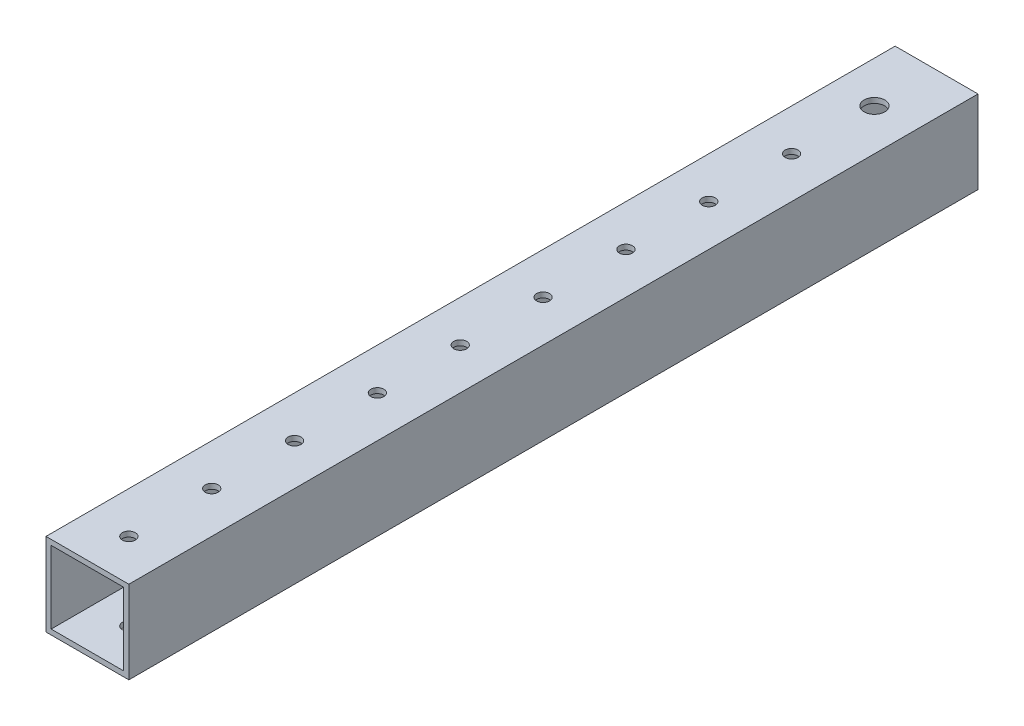
ISO-10303-21;
HEADER;
FILE_DESCRIPTION(('STEP AP214'),'2;1');
FILE_NAME('part.step','',(''),(''),'','','');
FILE_SCHEMA(('AUTOMOTIVE_DESIGN { 1 0 10303 214 1 1 1 1 }'));
ENDSEC;
DATA;
#1=APPLICATION_CONTEXT('core data for automotive mechanical design processes');
#2=APPLICATION_PROTOCOL_DEFINITION('international standard','automotive_design',2000,#1);
#3=PRODUCT_CONTEXT('',#1,'mechanical');
#4=PRODUCT('Part','Part','',(#3));
#5=PRODUCT_RELATED_PRODUCT_CATEGORY('part','',(#4));
#6=PRODUCT_DEFINITION_FORMATION('','',#4);
#7=PRODUCT_DEFINITION_CONTEXT('part definition',#1,'design');
#8=PRODUCT_DEFINITION('design','',#6,#7);
#9=PRODUCT_DEFINITION_SHAPE('','',#8);
#10=(LENGTH_UNIT() NAMED_UNIT(*) SI_UNIT(.MILLI.,.METRE.));
#11=(NAMED_UNIT(*) PLANE_ANGLE_UNIT() SI_UNIT($,.RADIAN.));
#12=(NAMED_UNIT(*) SI_UNIT($,.STERADIAN.) SOLID_ANGLE_UNIT());
#13=UNCERTAINTY_MEASURE_WITH_UNIT(LENGTH_MEASURE(1.E-05),#10,'distance_accuracy_value','');
#14=(GEOMETRIC_REPRESENTATION_CONTEXT(3) GLOBAL_UNCERTAINTY_ASSIGNED_CONTEXT((#13)) GLOBAL_UNIT_ASSIGNED_CONTEXT((#10,
#11,#12)) REPRESENTATION_CONTEXT('',''));
#15=CARTESIAN_POINT('',(0.,0.,0.));
#16=DIRECTION('',(0.,0.,1.));
#17=DIRECTION('',(1.,0.,0.));
#18=AXIS2_PLACEMENT_3D('',#15,#16,#17);
#19=CARTESIAN_POINT('',(0.,0.,260.35));
#20=DIRECTION('',(0.,0.,1.));
#21=DIRECTION('',(1.,0.,0.));
#22=AXIS2_PLACEMENT_3D('',#19,#20,#21);
#23=PLANE('',#22);
#24=DIRECTION('',(0.,1.,0.));
#25=VECTOR('',#24,1.);
#26=CARTESIAN_POINT('',(12.7,12.7,260.35));
#27=LINE('',#26,#25);
#28=CARTESIAN_POINT('',(12.7,-12.7,260.35));
#29=VERTEX_POINT('',#28);
#30=CARTESIAN_POINT('',(12.7,12.7,260.35));
#31=VERTEX_POINT('',#30);
#32=EDGE_CURVE('E140',#29,#31,#27,.T.);
#33=ORIENTED_EDGE('',*,*,#32,.T.);
#34=DIRECTION('',(-1.,0.,0.));
#35=VECTOR('',#34,1.);
#36=CARTESIAN_POINT('',(-12.7,12.7,260.35));
#37=LINE('',#36,#35);
#38=CARTESIAN_POINT('',(-12.7,12.7,260.35));
#39=VERTEX_POINT('',#38);
#40=EDGE_CURVE('E143',#31,#39,#37,.T.);
#41=ORIENTED_EDGE('',*,*,#40,.T.);
#42=DIRECTION('',(0.,-1.,0.));
#43=VECTOR('',#42,1.);
#44=CARTESIAN_POINT('',(-12.7,12.7,260.35));
#45=LINE('',#44,#43);
#46=CARTESIAN_POINT('',(-12.7,-12.7,260.35));
#47=VERTEX_POINT('',#46);
#48=EDGE_CURVE('E146',#39,#47,#45,.T.);
#49=ORIENTED_EDGE('',*,*,#48,.T.);
#50=DIRECTION('',(1.,0.,0.));
#51=VECTOR('',#50,1.);
#52=CARTESIAN_POINT('',(-12.7,-12.7,260.35));
#53=LINE('',#52,#51);
#54=EDGE_CURVE('E148',#47,#29,#53,.T.);
#55=ORIENTED_EDGE('',*,*,#54,.T.);
#56=EDGE_LOOP('',(#33,#41,#49,#55));
#57=FACE_BOUND('',#56,.T.);
#58=DIRECTION('',(-1.,0.,0.));
#59=VECTOR('',#58,1.);
#60=CARTESIAN_POINT('',(-11.1125,11.1125,260.35));
#61=LINE('',#60,#59);
#62=CARTESIAN_POINT('',(11.1125,11.1125,260.35));
#63=VERTEX_POINT('',#62);
#64=CARTESIAN_POINT('',(-11.1125,11.1125,260.35));
#65=VERTEX_POINT('',#64);
#66=EDGE_CURVE('E110',#63,#65,#61,.T.);
#67=ORIENTED_EDGE('',*,*,#66,.F.);
#68=DIRECTION('',(0.,1.,0.));
#69=VECTOR('',#68,1.);
#70=CARTESIAN_POINT('',(11.1125,11.1125,260.35));
#71=LINE('',#70,#69);
#72=CARTESIAN_POINT('',(11.1125,-11.1125,260.35));
#73=VERTEX_POINT('',#72);
#74=EDGE_CURVE('E102',#73,#63,#71,.T.);
#75=ORIENTED_EDGE('',*,*,#74,.F.);
#76=DIRECTION('',(1.,0.,0.));
#77=VECTOR('',#76,1.);
#78=CARTESIAN_POINT('',(-11.1125,-11.1125,260.35));
#79=LINE('',#78,#77);
#80=CARTESIAN_POINT('',(-11.1125,-11.1125,260.35));
#81=VERTEX_POINT('',#80);
#82=EDGE_CURVE('E124',#81,#73,#79,.T.);
#83=ORIENTED_EDGE('',*,*,#82,.F.);
#84=DIRECTION('',(0.,-1.,0.));
#85=VECTOR('',#84,1.);
#86=CARTESIAN_POINT('',(-11.1125,11.1125,260.35));
#87=LINE('',#86,#85);
#88=EDGE_CURVE('E122',#65,#81,#87,.T.);
#89=ORIENTED_EDGE('',*,*,#88,.F.);
#90=EDGE_LOOP('',(#67,#75,#83,#89));
#91=FACE_BOUND('',#90,.T.);
#92=ADVANCED_FACE('F35',(#57,#91),#23,.T.);
#93=CARTESIAN_POINT('',(0.,0.,0.));
#94=DIRECTION('',(0.,0.,1.));
#95=DIRECTION('',(1.,0.,0.));
#96=AXIS2_PLACEMENT_3D('',#93,#94,#95);
#97=PLANE('',#96);
#98=DIRECTION('',(0.,1.,0.));
#99=VECTOR('',#98,1.);
#100=CARTESIAN_POINT('',(12.7,12.7,0.));
#101=LINE('',#100,#99);
#102=CARTESIAN_POINT('',(12.7,-12.7,0.));
#103=VERTEX_POINT('',#102);
#104=CARTESIAN_POINT('',(12.7,12.7,0.));
#105=VERTEX_POINT('',#104);
#106=EDGE_CURVE('E118',#103,#105,#101,.T.);
#107=ORIENTED_EDGE('',*,*,#106,.F.);
#108=DIRECTION('',(1.,0.,0.));
#109=VECTOR('',#108,1.);
#110=CARTESIAN_POINT('',(-12.7,-12.7,0.));
#111=LINE('',#110,#109);
#112=CARTESIAN_POINT('',(-12.7,-12.7,0.));
#113=VERTEX_POINT('',#112);
#114=EDGE_CURVE('E144',#113,#103,#111,.T.);
#115=ORIENTED_EDGE('',*,*,#114,.F.);
#116=DIRECTION('',(0.,-1.,0.));
#117=VECTOR('',#116,1.);
#118=CARTESIAN_POINT('',(-12.7,12.7,0.));
#119=LINE('',#118,#117);
#120=CARTESIAN_POINT('',(-12.7,12.7,0.));
#121=VERTEX_POINT('',#120);
#122=EDGE_CURVE('E155',#121,#113,#119,.T.);
#123=ORIENTED_EDGE('',*,*,#122,.F.);
#124=DIRECTION('',(-1.,0.,0.));
#125=VECTOR('',#124,1.);
#126=CARTESIAN_POINT('',(-12.7,12.7,0.));
#127=LINE('',#126,#125);
#128=EDGE_CURVE('E153',#105,#121,#127,.T.);
#129=ORIENTED_EDGE('',*,*,#128,.F.);
#130=EDGE_LOOP('',(#107,#115,#123,#129));
#131=FACE_BOUND('',#130,.T.);
#132=DIRECTION('',(0.,1.,0.));
#133=VECTOR('',#132,1.);
#134=CARTESIAN_POINT('',(11.1125,11.1125,0.));
#135=LINE('',#134,#133);
#136=CARTESIAN_POINT('',(11.1125,-11.1125,0.));
#137=VERTEX_POINT('',#136);
#138=CARTESIAN_POINT('',(11.1125,11.1125,0.));
#139=VERTEX_POINT('',#138);
#140=EDGE_CURVE('E60',#137,#139,#135,.T.);
#141=ORIENTED_EDGE('',*,*,#140,.T.);
#142=DIRECTION('',(-1.,0.,0.));
#143=VECTOR('',#142,1.);
#144=CARTESIAN_POINT('',(-11.1125,11.1125,0.));
#145=LINE('',#144,#143);
#146=CARTESIAN_POINT('',(-11.1125,11.1125,0.));
#147=VERTEX_POINT('',#146);
#148=EDGE_CURVE('E117',#139,#147,#145,.T.);
#149=ORIENTED_EDGE('',*,*,#148,.T.);
#150=DIRECTION('',(0.,-1.,0.));
#151=VECTOR('',#150,1.);
#152=CARTESIAN_POINT('',(-11.1125,11.1125,0.));
#153=LINE('',#152,#151);
#154=CARTESIAN_POINT('',(-11.1125,-11.1125,0.));
#155=VERTEX_POINT('',#154);
#156=EDGE_CURVE('E132',#147,#155,#153,.T.);
#157=ORIENTED_EDGE('',*,*,#156,.T.);
#158=DIRECTION('',(1.,0.,0.));
#159=VECTOR('',#158,1.);
#160=CARTESIAN_POINT('',(-11.1125,-11.1125,0.));
#161=LINE('',#160,#159);
#162=EDGE_CURVE('E111',#155,#137,#161,.T.);
#163=ORIENTED_EDGE('',*,*,#162,.T.);
#164=EDGE_LOOP('',(#141,#149,#157,#163));
#165=FACE_BOUND('',#164,.T.);
#166=ADVANCED_FACE('F297',(#131,#165),#97,.F.);
#167=CARTESIAN_POINT('',(12.7,12.7,260.35));
#168=DIRECTION('',(-1.,0.,0.));
#169=DIRECTION('',(0.,-1.,0.));
#170=AXIS2_PLACEMENT_3D('',#167,#168,#169);
#171=PLANE('',#170);
#172=ORIENTED_EDGE('',*,*,#106,.T.);
#173=DIRECTION('',(0.,0.,-1.));
#174=VECTOR('',#173,1.);
#175=CARTESIAN_POINT('',(12.7,12.7,260.35));
#176=LINE('',#175,#174);
#177=EDGE_CURVE('E11',#31,#105,#176,.T.);
#178=ORIENTED_EDGE('',*,*,#177,.F.);
#179=ORIENTED_EDGE('',*,*,#32,.F.);
#180=DIRECTION('',(0.,0.,-1.));
#181=VECTOR('',#180,1.);
#182=CARTESIAN_POINT('',(12.7,-12.7,260.35));
#183=LINE('',#182,#181);
#184=EDGE_CURVE('E150',#29,#103,#183,.T.);
#185=ORIENTED_EDGE('',*,*,#184,.T.);
#186=EDGE_LOOP('',(#172,#178,#179,#185));
#187=FACE_BOUND('',#186,.T.);
#188=ADVANCED_FACE('F37',(#187),#171,.F.);
#189=CARTESIAN_POINT('',(-12.7,12.7,260.35));
#190=DIRECTION('',(0.,-1.,0.));
#191=DIRECTION('',(0.,0.,-1.));
#192=AXIS2_PLACEMENT_3D('',#189,#190,#191);
#193=PLANE('',#192);
#194=CARTESIAN_POINT('',(-7.09469008052924E-13,12.7,44.4500000000002));
#195=DIRECTION('',(0.,1.,0.));
#196=DIRECTION('',(0.,0.,1.));
#197=AXIS2_PLACEMENT_3D('',#194,#195,#196);
#198=CIRCLE('',#197,1.98437499999999);
#199=CARTESIAN_POINT('',(-7.09469008052924E-13,12.7,46.4343750000002));
#200=VERTEX_POINT('',#199);
#201=EDGE_CURVE('E322',#200,#200,#198,.T.);
#202=ORIENTED_EDGE('',*,*,#201,.F.);
#203=EDGE_LOOP('',(#202));
#204=FACE_BOUND('',#203,.T.);
#205=CARTESIAN_POINT('',(-6.20785382046309E-13,12.7,69.8500000000001));
#206=DIRECTION('',(0.,1.,0.));
#207=DIRECTION('',(0.,0.,1.));
#208=AXIS2_PLACEMENT_3D('',#205,#206,#207);
#209=CIRCLE('',#208,1.98437499999999);
#210=CARTESIAN_POINT('',(-6.20785382046309E-13,12.7,71.8343750000001));
#211=VERTEX_POINT('',#210);
#212=EDGE_CURVE('E213',#211,#211,#209,.T.);
#213=ORIENTED_EDGE('',*,*,#212,.F.);
#214=EDGE_LOOP('',(#213));
#215=FACE_BOUND('',#214,.T.);
#216=CARTESIAN_POINT('',(-5.32101756039693E-13,12.7,95.2500000000001));
#217=DIRECTION('',(0.,1.,0.));
#218=DIRECTION('',(0.,0.,1.));
#219=AXIS2_PLACEMENT_3D('',#216,#217,#218);
#220=CIRCLE('',#219,1.98437499999999);
#221=CARTESIAN_POINT('',(-5.32101756039693E-13,12.7,97.2343750000001));
#222=VERTEX_POINT('',#221);
#223=EDGE_CURVE('E210',#222,#222,#220,.T.);
#224=ORIENTED_EDGE('',*,*,#223,.F.);
#225=EDGE_LOOP('',(#224));
#226=FACE_BOUND('',#225,.T.);
#227=CARTESIAN_POINT('',(-4.43418130033078E-13,12.7,120.65));
#228=DIRECTION('',(0.,1.,0.));
#229=DIRECTION('',(0.,0.,1.));
#230=AXIS2_PLACEMENT_3D('',#227,#228,#229);
#231=CIRCLE('',#230,1.98437499999999);
#232=CARTESIAN_POINT('',(-4.43418130033078E-13,12.7,122.634375));
#233=VERTEX_POINT('',#232);
#234=EDGE_CURVE('E229',#233,#233,#231,.T.);
#235=ORIENTED_EDGE('',*,*,#234,.F.);
#236=EDGE_LOOP('',(#235));
#237=FACE_BOUND('',#236,.T.);
#238=CARTESIAN_POINT('',(-3.54734504026462E-13,12.7,146.05));
#239=DIRECTION('',(0.,1.,0.));
#240=DIRECTION('',(0.,0.,1.));
#241=AXIS2_PLACEMENT_3D('',#238,#239,#240);
#242=CIRCLE('',#241,1.984375);
#243=CARTESIAN_POINT('',(-3.54734504026462E-13,12.7,148.034375));
#244=VERTEX_POINT('',#243);
#245=EDGE_CURVE('E236',#244,#244,#242,.T.);
#246=ORIENTED_EDGE('',*,*,#245,.F.);
#247=EDGE_LOOP('',(#246));
#248=FACE_BOUND('',#247,.T.);
#249=CARTESIAN_POINT('',(-2.66050878019846E-13,12.7,171.45));
#250=DIRECTION('',(0.,1.,0.));
#251=DIRECTION('',(0.,0.,1.));
#252=AXIS2_PLACEMENT_3D('',#249,#250,#251);
#253=CIRCLE('',#252,1.984375);
#254=CARTESIAN_POINT('',(-2.66050878019846E-13,12.7,173.434375));
#255=VERTEX_POINT('',#254);
#256=EDGE_CURVE('E243',#255,#255,#253,.T.);
#257=ORIENTED_EDGE('',*,*,#256,.F.);
#258=EDGE_LOOP('',(#257));
#259=FACE_BOUND('',#258,.T.);
#260=CARTESIAN_POINT('',(-1.77367252013231E-13,12.7,196.85));
#261=DIRECTION('',(0.,1.,0.));
#262=DIRECTION('',(0.,0.,1.));
#263=AXIS2_PLACEMENT_3D('',#260,#261,#262);
#264=CIRCLE('',#263,1.984375);
#265=CARTESIAN_POINT('',(-1.77367252013231E-13,12.7,198.834375));
#266=VERTEX_POINT('',#265);
#267=EDGE_CURVE('E250',#266,#266,#264,.T.);
#268=ORIENTED_EDGE('',*,*,#267,.F.);
#269=EDGE_LOOP('',(#268));
#270=FACE_BOUND('',#269,.T.);
#271=CARTESIAN_POINT('',(0.,12.7,222.25));
#272=DIRECTION('',(0.,1.,0.));
#273=DIRECTION('',(0.,0.,1.));
#274=AXIS2_PLACEMENT_3D('',#271,#272,#273);
#275=CIRCLE('',#274,1.984375);
#276=CARTESIAN_POINT('',(0.,12.7,224.234375));
#277=VERTEX_POINT('',#276);
#278=EDGE_CURVE('E257',#277,#277,#275,.T.);
#279=ORIENTED_EDGE('',*,*,#278,.F.);
#280=EDGE_LOOP('',(#279));
#281=FACE_BOUND('',#280,.T.);
#282=CARTESIAN_POINT('',(-7.9815263405954E-13,12.7,19.0500000000002));
#283=DIRECTION('',(0.,1.,0.));
#284=DIRECTION('',(0.,0.,1.));
#285=AXIS2_PLACEMENT_3D('',#282,#283,#284);
#286=CIRCLE('',#285,3.175);
#287=CARTESIAN_POINT('',(-7.9815263405954E-13,12.7,22.2250000000002));
#288=VERTEX_POINT('',#287);
#289=EDGE_CURVE('E264',#288,#288,#286,.T.);
#290=ORIENTED_EDGE('',*,*,#289,.F.);
#291=EDGE_LOOP('',(#290));
#292=FACE_BOUND('',#291,.T.);
#293=CARTESIAN_POINT('',(0.,12.7,247.65));
#294=DIRECTION('',(0.,1.,0.));
#295=DIRECTION('',(0.,0.,1.));
#296=AXIS2_PLACEMENT_3D('',#293,#294,#295);
#297=CIRCLE('',#296,1.984375);
#298=CARTESIAN_POINT('',(0.,12.7,249.634375));
#299=VERTEX_POINT('',#298);
#300=EDGE_CURVE('E271',#299,#299,#297,.T.);
#301=ORIENTED_EDGE('',*,*,#300,.F.);
#302=EDGE_LOOP('',(#301));
#303=FACE_BOUND('',#302,.T.);
#304=ORIENTED_EDGE('',*,*,#128,.T.);
#305=DIRECTION('',(0.,0.,-1.));
#306=VECTOR('',#305,1.);
#307=CARTESIAN_POINT('',(-12.7,12.7,260.35));
#308=LINE('',#307,#306);
#309=EDGE_CURVE('E44',#39,#121,#308,.T.);
#310=ORIENTED_EDGE('',*,*,#309,.F.);
#311=ORIENTED_EDGE('',*,*,#40,.F.);
#312=ORIENTED_EDGE('',*,*,#177,.T.);
#313=EDGE_LOOP('',(#304,#310,#311,#312));
#314=FACE_BOUND('',#313,.T.);
#315=ADVANCED_FACE('F311',(#204,#215,#226,#237,#248,#259,#270,#281,#292,#303,#314),#193,.F.);
#316=CARTESIAN_POINT('',(-12.7,12.7,260.35));
#317=DIRECTION('',(1.,0.,0.));
#318=DIRECTION('',(0.,1.,0.));
#319=AXIS2_PLACEMENT_3D('',#316,#317,#318);
#320=PLANE('',#319);
#321=ORIENTED_EDGE('',*,*,#122,.T.);
#322=DIRECTION('',(0.,0.,-1.));
#323=VECTOR('',#322,1.);
#324=CARTESIAN_POINT('',(-12.7,-12.7,260.35));
#325=LINE('',#324,#323);
#326=EDGE_CURVE('E160',#47,#113,#325,.T.);
#327=ORIENTED_EDGE('',*,*,#326,.F.);
#328=ORIENTED_EDGE('',*,*,#48,.F.);
#329=ORIENTED_EDGE('',*,*,#309,.T.);
#330=EDGE_LOOP('',(#321,#327,#328,#329));
#331=FACE_BOUND('',#330,.T.);
#332=ADVANCED_FACE('F308',(#331),#320,.F.);
#333=CARTESIAN_POINT('',(-12.7,-12.7,260.35));
#334=DIRECTION('',(0.,1.,0.));
#335=DIRECTION('',(0.,0.,1.));
#336=AXIS2_PLACEMENT_3D('',#333,#334,#335);
#337=PLANE('',#336);
#338=CARTESIAN_POINT('',(-7.09469008052924E-13,-12.7,44.4500000000002));
#339=DIRECTION('',(0.,1.,0.));
#340=DIRECTION('',(0.,0.,1.));
#341=AXIS2_PLACEMENT_3D('',#338,#339,#340);
#342=CIRCLE('',#341,1.98437499999999);
#343=CARTESIAN_POINT('',(-7.09469008052924E-13,-12.7,46.4343750000002));
#344=VERTEX_POINT('',#343);
#345=EDGE_CURVE('E419',#344,#344,#342,.T.);
#346=ORIENTED_EDGE('',*,*,#345,.T.);
#347=EDGE_LOOP('',(#346));
#348=FACE_BOUND('',#347,.T.);
#349=CARTESIAN_POINT('',(-6.20785382046309E-13,-12.7,69.8500000000001));
#350=DIRECTION('',(0.,1.,0.));
#351=DIRECTION('',(0.,0.,1.));
#352=AXIS2_PLACEMENT_3D('',#349,#350,#351);
#353=CIRCLE('',#352,1.98437499999999);
#354=CARTESIAN_POINT('',(-6.20785382046309E-13,-12.7,71.8343750000001));
#355=VERTEX_POINT('',#354);
#356=EDGE_CURVE('E206',#355,#355,#353,.T.);
#357=ORIENTED_EDGE('',*,*,#356,.T.);
#358=EDGE_LOOP('',(#357));
#359=FACE_BOUND('',#358,.T.);
#360=CARTESIAN_POINT('',(-5.32101756039693E-13,-12.7,95.2500000000001));
#361=DIRECTION('',(0.,1.,0.));
#362=DIRECTION('',(0.,0.,1.));
#363=AXIS2_PLACEMENT_3D('',#360,#361,#362);
#364=CIRCLE('',#363,1.98437499999999);
#365=CARTESIAN_POINT('',(-5.32101756039693E-13,-12.7,97.2343750000001));
#366=VERTEX_POINT('',#365);
#367=EDGE_CURVE('E202',#366,#366,#364,.T.);
#368=ORIENTED_EDGE('',*,*,#367,.T.);
#369=EDGE_LOOP('',(#368));
#370=FACE_BOUND('',#369,.T.);
#371=CARTESIAN_POINT('',(-4.43418130033078E-13,-12.7,120.65));
#372=DIRECTION('',(0.,1.,0.));
#373=DIRECTION('',(0.,0.,1.));
#374=AXIS2_PLACEMENT_3D('',#371,#372,#373);
#375=CIRCLE('',#374,1.98437499999999);
#376=CARTESIAN_POINT('',(-4.43418130033078E-13,-12.7,122.634375));
#377=VERTEX_POINT('',#376);
#378=EDGE_CURVE('E198',#377,#377,#375,.T.);
#379=ORIENTED_EDGE('',*,*,#378,.T.);
#380=EDGE_LOOP('',(#379));
#381=FACE_BOUND('',#380,.T.);
#382=CARTESIAN_POINT('',(-3.54734504026462E-13,-12.7,146.05));
#383=DIRECTION('',(0.,1.,0.));
#384=DIRECTION('',(0.,0.,1.));
#385=AXIS2_PLACEMENT_3D('',#382,#383,#384);
#386=CIRCLE('',#385,1.984375);
#387=CARTESIAN_POINT('',(-3.54734504026462E-13,-12.7,148.034375));
#388=VERTEX_POINT('',#387);
#389=EDGE_CURVE('E193',#388,#388,#386,.T.);
#390=ORIENTED_EDGE('',*,*,#389,.T.);
#391=EDGE_LOOP('',(#390));
#392=FACE_BOUND('',#391,.T.);
#393=CARTESIAN_POINT('',(-2.66050878019846E-13,-12.7,171.45));
#394=DIRECTION('',(0.,1.,0.));
#395=DIRECTION('',(0.,0.,1.));
#396=AXIS2_PLACEMENT_3D('',#393,#394,#395);
#397=CIRCLE('',#396,1.984375);
#398=CARTESIAN_POINT('',(-2.66050878019846E-13,-12.7,173.434375));
#399=VERTEX_POINT('',#398);
#400=EDGE_CURVE('E188',#399,#399,#397,.T.);
#401=ORIENTED_EDGE('',*,*,#400,.T.);
#402=EDGE_LOOP('',(#401));
#403=FACE_BOUND('',#402,.T.);
#404=CARTESIAN_POINT('',(-1.77367252013231E-13,-12.7,196.85));
#405=DIRECTION('',(0.,1.,0.));
#406=DIRECTION('',(0.,0.,1.));
#407=AXIS2_PLACEMENT_3D('',#404,#405,#406);
#408=CIRCLE('',#407,1.984375);
#409=CARTESIAN_POINT('',(-1.77367252013231E-13,-12.7,198.834375));
#410=VERTEX_POINT('',#409);
#411=EDGE_CURVE('E183',#410,#410,#408,.T.);
#412=ORIENTED_EDGE('',*,*,#411,.T.);
#413=EDGE_LOOP('',(#412));
#414=FACE_BOUND('',#413,.T.);
#415=CARTESIAN_POINT('',(0.,-12.7,222.25));
#416=DIRECTION('',(0.,1.,0.));
#417=DIRECTION('',(0.,0.,1.));
#418=AXIS2_PLACEMENT_3D('',#415,#416,#417);
#419=CIRCLE('',#418,1.984375);
#420=CARTESIAN_POINT('',(0.,-12.7,224.234375));
#421=VERTEX_POINT('',#420);
#422=EDGE_CURVE('E178',#421,#421,#419,.T.);
#423=ORIENTED_EDGE('',*,*,#422,.T.);
#424=EDGE_LOOP('',(#423));
#425=FACE_BOUND('',#424,.T.);
#426=CARTESIAN_POINT('',(-7.9815263405954E-13,-12.7,19.0500000000002));
#427=DIRECTION('',(0.,1.,0.));
#428=DIRECTION('',(0.,0.,1.));
#429=AXIS2_PLACEMENT_3D('',#426,#427,#428);
#430=CIRCLE('',#429,3.175);
#431=CARTESIAN_POINT('',(-7.9815263405954E-13,-12.7,22.2250000000002));
#432=VERTEX_POINT('',#431);
#433=EDGE_CURVE('E173',#432,#432,#430,.T.);
#434=ORIENTED_EDGE('',*,*,#433,.T.);
#435=EDGE_LOOP('',(#434));
#436=FACE_BOUND('',#435,.T.);
#437=CARTESIAN_POINT('',(0.,-12.7,247.65));
#438=DIRECTION('',(0.,1.,0.));
#439=DIRECTION('',(0.,0.,1.));
#440=AXIS2_PLACEMENT_3D('',#437,#438,#439);
#441=CIRCLE('',#440,1.984375);
#442=CARTESIAN_POINT('',(0.,-12.7,249.634375));
#443=VERTEX_POINT('',#442);
#444=EDGE_CURVE('E168',#443,#443,#441,.T.);
#445=ORIENTED_EDGE('',*,*,#444,.T.);
#446=EDGE_LOOP('',(#445));
#447=FACE_BOUND('',#446,.T.);
#448=ORIENTED_EDGE('',*,*,#114,.T.);
#449=ORIENTED_EDGE('',*,*,#184,.F.);
#450=ORIENTED_EDGE('',*,*,#54,.F.);
#451=ORIENTED_EDGE('',*,*,#326,.T.);
#452=EDGE_LOOP('',(#448,#449,#450,#451));
#453=FACE_BOUND('',#452,.T.);
#454=ADVANCED_FACE('F292',(#348,#359,#370,#381,#392,#403,#414,#425,#436,#447,#453),#337,.F.);
#455=CARTESIAN_POINT('',(11.1125,11.1125,260.35));
#456=DIRECTION('',(-1.,0.,0.));
#457=DIRECTION('',(0.,0.,1.));
#458=AXIS2_PLACEMENT_3D('',#455,#456,#457);
#459=PLANE('',#458);
#460=ORIENTED_EDGE('',*,*,#140,.F.);
#461=DIRECTION('',(0.,0.,-1.));
#462=VECTOR('',#461,1.);
#463=CARTESIAN_POINT('',(11.1125,-11.1125,260.35));
#464=LINE('',#463,#462);
#465=EDGE_CURVE('E106',#73,#137,#464,.T.);
#466=ORIENTED_EDGE('',*,*,#465,.F.);
#467=ORIENTED_EDGE('',*,*,#74,.T.);
#468=DIRECTION('',(0.,0.,-1.));
#469=VECTOR('',#468,1.);
#470=CARTESIAN_POINT('',(11.1125,11.1125,260.35));
#471=LINE('',#470,#469);
#472=EDGE_CURVE('E105',#63,#139,#471,.T.);
#473=ORIENTED_EDGE('',*,*,#472,.T.);
#474=EDGE_LOOP('',(#460,#466,#467,#473));
#475=FACE_BOUND('',#474,.T.);
#476=ADVANCED_FACE('F104',(#475),#459,.T.);
#477=CARTESIAN_POINT('',(-11.1125,11.1125,260.35));
#478=DIRECTION('',(0.,-1.,0.));
#479=DIRECTION('',(0.,0.,-1.));
#480=AXIS2_PLACEMENT_3D('',#477,#478,#479);
#481=PLANE('',#480);
#482=CARTESIAN_POINT('',(-7.09469008052924E-13,11.1125,44.4500000000002));
#483=DIRECTION('',(0.,-1.,0.));
#484=DIRECTION('',(0.,0.,-1.));
#485=AXIS2_PLACEMENT_3D('',#482,#483,#484);
#486=CIRCLE('',#485,1.98437499999999);
#487=CARTESIAN_POINT('',(-7.09469008052924E-13,11.1125,42.4656250000002));
#488=VERTEX_POINT('',#487);
#489=EDGE_CURVE('E218',#488,#488,#486,.T.);
#490=ORIENTED_EDGE('',*,*,#489,.F.);
#491=EDGE_LOOP('',(#490));
#492=FACE_BOUND('',#491,.T.);
#493=CARTESIAN_POINT('',(-6.20785382046309E-13,11.1125,69.8500000000001));
#494=DIRECTION('',(0.,-1.,0.));
#495=DIRECTION('',(0.,0.,-1.));
#496=AXIS2_PLACEMENT_3D('',#493,#494,#495);
#497=CIRCLE('',#496,1.98437499999999);
#498=CARTESIAN_POINT('',(-6.20785382046309E-13,11.1125,67.8656250000001));
#499=VERTEX_POINT('',#498);
#500=EDGE_CURVE('E205',#499,#499,#497,.T.);
#501=ORIENTED_EDGE('',*,*,#500,.F.);
#502=EDGE_LOOP('',(#501));
#503=FACE_BOUND('',#502,.T.);
#504=CARTESIAN_POINT('',(-5.32101756039693E-13,11.1125,95.2500000000001));
#505=DIRECTION('',(0.,-1.,0.));
#506=DIRECTION('',(0.,0.,-1.));
#507=AXIS2_PLACEMENT_3D('',#504,#505,#506);
#508=CIRCLE('',#507,1.98437499999999);
#509=CARTESIAN_POINT('',(-5.32101756039693E-13,11.1125,93.2656250000001));
#510=VERTEX_POINT('',#509);
#511=EDGE_CURVE('E201',#510,#510,#508,.T.);
#512=ORIENTED_EDGE('',*,*,#511,.F.);
#513=EDGE_LOOP('',(#512));
#514=FACE_BOUND('',#513,.T.);
#515=CARTESIAN_POINT('',(-4.43418130033078E-13,11.1125,120.65));
#516=DIRECTION('',(0.,-1.,0.));
#517=DIRECTION('',(0.,0.,-1.));
#518=AXIS2_PLACEMENT_3D('',#515,#516,#517);
#519=CIRCLE('',#518,1.98437499999999);
#520=CARTESIAN_POINT('',(-4.43418130033078E-13,11.1125,118.665625));
#521=VERTEX_POINT('',#520);
#522=EDGE_CURVE('E197',#521,#521,#519,.T.);
#523=ORIENTED_EDGE('',*,*,#522,.F.);
#524=EDGE_LOOP('',(#523));
#525=FACE_BOUND('',#524,.T.);
#526=CARTESIAN_POINT('',(-3.54734504026462E-13,11.1125,146.05));
#527=DIRECTION('',(0.,-1.,0.));
#528=DIRECTION('',(0.,0.,-1.));
#529=AXIS2_PLACEMENT_3D('',#526,#527,#528);
#530=CIRCLE('',#529,1.984375);
#531=CARTESIAN_POINT('',(-3.54734504026462E-13,11.1125,144.065625));
#532=VERTEX_POINT('',#531);
#533=EDGE_CURVE('E192',#532,#532,#530,.T.);
#534=ORIENTED_EDGE('',*,*,#533,.F.);
#535=EDGE_LOOP('',(#534));
#536=FACE_BOUND('',#535,.T.);
#537=CARTESIAN_POINT('',(-2.66050878019846E-13,11.1125,171.45));
#538=DIRECTION('',(0.,-1.,0.));
#539=DIRECTION('',(0.,0.,-1.));
#540=AXIS2_PLACEMENT_3D('',#537,#538,#539);
#541=CIRCLE('',#540,1.984375);
#542=CARTESIAN_POINT('',(-2.66050878019846E-13,11.1125,169.465625));
#543=VERTEX_POINT('',#542);
#544=EDGE_CURVE('E187',#543,#543,#541,.T.);
#545=ORIENTED_EDGE('',*,*,#544,.F.);
#546=EDGE_LOOP('',(#545));
#547=FACE_BOUND('',#546,.T.);
#548=CARTESIAN_POINT('',(-1.77367252013231E-13,11.1125,196.85));
#549=DIRECTION('',(0.,-1.,0.));
#550=DIRECTION('',(0.,0.,-1.));
#551=AXIS2_PLACEMENT_3D('',#548,#549,#550);
#552=CIRCLE('',#551,1.984375);
#553=CARTESIAN_POINT('',(-1.77367252013231E-13,11.1125,194.865625));
#554=VERTEX_POINT('',#553);
#555=EDGE_CURVE('E182',#554,#554,#552,.T.);
#556=ORIENTED_EDGE('',*,*,#555,.F.);
#557=EDGE_LOOP('',(#556));
#558=FACE_BOUND('',#557,.T.);
#559=CARTESIAN_POINT('',(0.,11.1125,222.25));
#560=DIRECTION('',(0.,-1.,0.));
#561=DIRECTION('',(0.,0.,-1.));
#562=AXIS2_PLACEMENT_3D('',#559,#560,#561);
#563=CIRCLE('',#562,1.984375);
#564=CARTESIAN_POINT('',(0.,11.1125,220.265625));
#565=VERTEX_POINT('',#564);
#566=EDGE_CURVE('E177',#565,#565,#563,.T.);
#567=ORIENTED_EDGE('',*,*,#566,.F.);
#568=EDGE_LOOP('',(#567));
#569=FACE_BOUND('',#568,.T.);
#570=CARTESIAN_POINT('',(-7.9815263405954E-13,11.1125,19.0500000000002));
#571=DIRECTION('',(0.,-1.,0.));
#572=DIRECTION('',(0.,0.,-1.));
#573=AXIS2_PLACEMENT_3D('',#570,#571,#572);
#574=CIRCLE('',#573,3.175);
#575=CARTESIAN_POINT('',(-7.9815263405954E-13,11.1125,15.8750000000002));
#576=VERTEX_POINT('',#575);
#577=EDGE_CURVE('E172',#576,#576,#574,.T.);
#578=ORIENTED_EDGE('',*,*,#577,.F.);
#579=EDGE_LOOP('',(#578));
#580=FACE_BOUND('',#579,.T.);
#581=CARTESIAN_POINT('',(0.,11.1125,247.65));
#582=DIRECTION('',(0.,-1.,0.));
#583=DIRECTION('',(0.,0.,-1.));
#584=AXIS2_PLACEMENT_3D('',#581,#582,#583);
#585=CIRCLE('',#584,1.984375);
#586=CARTESIAN_POINT('',(0.,11.1125,245.665625));
#587=VERTEX_POINT('',#586);
#588=EDGE_CURVE('E130',#587,#587,#585,.T.);
#589=ORIENTED_EDGE('',*,*,#588,.F.);
#590=EDGE_LOOP('',(#589));
#591=FACE_BOUND('',#590,.T.);
#592=ORIENTED_EDGE('',*,*,#148,.F.);
#593=ORIENTED_EDGE('',*,*,#472,.F.);
#594=ORIENTED_EDGE('',*,*,#66,.T.);
#595=DIRECTION('',(0.,0.,-1.));
#596=VECTOR('',#595,1.);
#597=CARTESIAN_POINT('',(-11.1125,11.1125,260.35));
#598=LINE('',#597,#596);
#599=EDGE_CURVE('E119',#65,#147,#598,.T.);
#600=ORIENTED_EDGE('',*,*,#599,.T.);
#601=EDGE_LOOP('',(#592,#593,#594,#600));
#602=FACE_BOUND('',#601,.T.);
#603=ADVANCED_FACE('F114',(#492,#503,#514,#525,#536,#547,#558,#569,#580,#591,#602),#481,.T.);
#604=CARTESIAN_POINT('',(-11.1125,11.1125,260.35));
#605=DIRECTION('',(1.,0.,0.));
#606=DIRECTION('',(0.,1.,0.));
#607=AXIS2_PLACEMENT_3D('',#604,#605,#606);
#608=PLANE('',#607);
#609=ORIENTED_EDGE('',*,*,#156,.F.);
#610=ORIENTED_EDGE('',*,*,#599,.F.);
#611=ORIENTED_EDGE('',*,*,#88,.T.);
#612=DIRECTION('',(0.,0.,-1.));
#613=VECTOR('',#612,1.);
#614=CARTESIAN_POINT('',(-11.1125,-11.1125,260.35));
#615=LINE('',#614,#613);
#616=EDGE_CURVE('E52',#81,#155,#615,.T.);
#617=ORIENTED_EDGE('',*,*,#616,.T.);
#618=EDGE_LOOP('',(#609,#610,#611,#617));
#619=FACE_BOUND('',#618,.T.);
#620=ADVANCED_FACE('F282',(#619),#608,.T.);
#621=CARTESIAN_POINT('',(-11.1125,-11.1125,260.35));
#622=DIRECTION('',(0.,1.,0.));
#623=DIRECTION('',(0.,0.,1.));
#624=AXIS2_PLACEMENT_3D('',#621,#622,#623);
#625=PLANE('',#624);
#626=CARTESIAN_POINT('',(-7.09469008052924E-13,-11.1125,44.4500000000002));
#627=DIRECTION('',(0.,1.,0.));
#628=DIRECTION('',(0.,0.,1.));
#629=AXIS2_PLACEMENT_3D('',#626,#627,#628);
#630=CIRCLE('',#629,1.98437499999999);
#631=CARTESIAN_POINT('',(-7.09469008052924E-13,-11.1125,46.4343750000002));
#632=VERTEX_POINT('',#631);
#633=EDGE_CURVE('E39',#632,#632,#630,.T.);
#634=ORIENTED_EDGE('',*,*,#633,.F.);
#635=EDGE_LOOP('',(#634));
#636=FACE_BOUND('',#635,.T.);
#637=CARTESIAN_POINT('',(-6.20785382046309E-13,-11.1125,69.8500000000001));
#638=DIRECTION('',(0.,1.,0.));
#639=DIRECTION('',(0.,0.,1.));
#640=AXIS2_PLACEMENT_3D('',#637,#638,#639);
#641=CIRCLE('',#640,1.98437499999999);
#642=CARTESIAN_POINT('',(-6.20785382046309E-13,-11.1125,71.8343750000001));
#643=VERTEX_POINT('',#642);
#644=EDGE_CURVE('E203',#643,#643,#641,.T.);
#645=ORIENTED_EDGE('',*,*,#644,.F.);
#646=EDGE_LOOP('',(#645));
#647=FACE_BOUND('',#646,.T.);
#648=CARTESIAN_POINT('',(-5.32101756039693E-13,-11.1125,95.2500000000001));
#649=DIRECTION('',(0.,1.,0.));
#650=DIRECTION('',(0.,0.,1.));
#651=AXIS2_PLACEMENT_3D('',#648,#649,#650);
#652=CIRCLE('',#651,1.98437499999999);
#653=CARTESIAN_POINT('',(-5.32101756039693E-13,-11.1125,97.2343750000001));
#654=VERTEX_POINT('',#653);
#655=EDGE_CURVE('E199',#654,#654,#652,.T.);
#656=ORIENTED_EDGE('',*,*,#655,.F.);
#657=EDGE_LOOP('',(#656));
#658=FACE_BOUND('',#657,.T.);
#659=CARTESIAN_POINT('',(-4.43418130033078E-13,-11.1125,120.65));
#660=DIRECTION('',(0.,1.,0.));
#661=DIRECTION('',(0.,0.,1.));
#662=AXIS2_PLACEMENT_3D('',#659,#660,#661);
#663=CIRCLE('',#662,1.98437499999999);
#664=CARTESIAN_POINT('',(-4.43418130033078E-13,-11.1125,122.634375));
#665=VERTEX_POINT('',#664);
#666=EDGE_CURVE('E194',#665,#665,#663,.T.);
#667=ORIENTED_EDGE('',*,*,#666,.F.);
#668=EDGE_LOOP('',(#667));
#669=FACE_BOUND('',#668,.T.);
#670=CARTESIAN_POINT('',(-3.54734504026462E-13,-11.1125,146.05));
#671=DIRECTION('',(0.,1.,0.));
#672=DIRECTION('',(0.,0.,1.));
#673=AXIS2_PLACEMENT_3D('',#670,#671,#672);
#674=CIRCLE('',#673,1.984375);
#675=CARTESIAN_POINT('',(-3.54734504026462E-13,-11.1125,148.034375));
#676=VERTEX_POINT('',#675);
#677=EDGE_CURVE('E189',#676,#676,#674,.T.);
#678=ORIENTED_EDGE('',*,*,#677,.F.);
#679=EDGE_LOOP('',(#678));
#680=FACE_BOUND('',#679,.T.);
#681=CARTESIAN_POINT('',(-2.66050878019846E-13,-11.1125,171.45));
#682=DIRECTION('',(0.,1.,0.));
#683=DIRECTION('',(0.,0.,1.));
#684=AXIS2_PLACEMENT_3D('',#681,#682,#683);
#685=CIRCLE('',#684,1.984375);
#686=CARTESIAN_POINT('',(-2.66050878019846E-13,-11.1125,173.434375));
#687=VERTEX_POINT('',#686);
#688=EDGE_CURVE('E184',#687,#687,#685,.T.);
#689=ORIENTED_EDGE('',*,*,#688,.F.);
#690=EDGE_LOOP('',(#689));
#691=FACE_BOUND('',#690,.T.);
#692=CARTESIAN_POINT('',(-1.77367252013231E-13,-11.1125,196.85));
#693=DIRECTION('',(0.,1.,0.));
#694=DIRECTION('',(0.,0.,1.));
#695=AXIS2_PLACEMENT_3D('',#692,#693,#694);
#696=CIRCLE('',#695,1.984375);
#697=CARTESIAN_POINT('',(-1.77367252013231E-13,-11.1125,198.834375));
#698=VERTEX_POINT('',#697);
#699=EDGE_CURVE('E179',#698,#698,#696,.T.);
#700=ORIENTED_EDGE('',*,*,#699,.F.);
#701=EDGE_LOOP('',(#700));
#702=FACE_BOUND('',#701,.T.);
#703=CARTESIAN_POINT('',(0.,-11.1125,222.25));
#704=DIRECTION('',(0.,1.,0.));
#705=DIRECTION('',(0.,0.,1.));
#706=AXIS2_PLACEMENT_3D('',#703,#704,#705);
#707=CIRCLE('',#706,1.984375);
#708=CARTESIAN_POINT('',(0.,-11.1125,224.234375));
#709=VERTEX_POINT('',#708);
#710=EDGE_CURVE('E174',#709,#709,#707,.T.);
#711=ORIENTED_EDGE('',*,*,#710,.F.);
#712=EDGE_LOOP('',(#711));
#713=FACE_BOUND('',#712,.T.);
#714=CARTESIAN_POINT('',(-7.9815263405954E-13,-11.1125,19.0500000000002));
#715=DIRECTION('',(0.,1.,0.));
#716=DIRECTION('',(0.,0.,1.));
#717=AXIS2_PLACEMENT_3D('',#714,#715,#716);
#718=CIRCLE('',#717,3.175);
#719=CARTESIAN_POINT('',(-7.9815263405954E-13,-11.1125,22.2250000000002));
#720=VERTEX_POINT('',#719);
#721=EDGE_CURVE('E169',#720,#720,#718,.T.);
#722=ORIENTED_EDGE('',*,*,#721,.F.);
#723=EDGE_LOOP('',(#722));
#724=FACE_BOUND('',#723,.T.);
#725=CARTESIAN_POINT('',(0.,-11.1125,247.65));
#726=DIRECTION('',(0.,1.,0.));
#727=DIRECTION('',(0.,0.,1.));
#728=AXIS2_PLACEMENT_3D('',#725,#726,#727);
#729=CIRCLE('',#728,1.984375);
#730=CARTESIAN_POINT('',(0.,-11.1125,249.634375));
#731=VERTEX_POINT('',#730);
#732=EDGE_CURVE('E165',#731,#731,#729,.T.);
#733=ORIENTED_EDGE('',*,*,#732,.F.);
#734=EDGE_LOOP('',(#733));
#735=FACE_BOUND('',#734,.T.);
#736=ORIENTED_EDGE('',*,*,#162,.F.);
#737=ORIENTED_EDGE('',*,*,#616,.F.);
#738=ORIENTED_EDGE('',*,*,#82,.T.);
#739=ORIENTED_EDGE('',*,*,#465,.T.);
#740=EDGE_LOOP('',(#736,#737,#738,#739));
#741=FACE_BOUND('',#740,.T.);
#742=ADVANCED_FACE('F289',(#636,#647,#658,#669,#680,#691,#702,#713,#724,#735,#741),#625,.T.);
#743=CARTESIAN_POINT('',(0.,-12.7,247.65));
#744=DIRECTION('',(0.,1.,0.));
#745=DIRECTION('',(0.,0.,1.));
#746=AXIS2_PLACEMENT_3D('',#743,#744,#745);
#747=CYLINDRICAL_SURFACE('',#746,1.984375);
#748=ORIENTED_EDGE('',*,*,#732,.T.);
#749=EDGE_LOOP('',(#748));
#750=FACE_BOUND('',#749,.T.);
#751=ORIENTED_EDGE('',*,*,#444,.F.);
#752=EDGE_LOOP('',(#751));
#753=FACE_BOUND('',#752,.T.);
#754=ADVANCED_FACE('F355',(#750,#753),#747,.F.);
#755=ORIENTED_EDGE('',*,*,#588,.T.);
#756=EDGE_LOOP('',(#755));
#757=FACE_BOUND('',#756,.T.);
#758=ORIENTED_EDGE('',*,*,#300,.T.);
#759=EDGE_LOOP('',(#758));
#760=FACE_BOUND('',#759,.T.);
#761=ADVANCED_FACE('F278',(#757,#760),#747,.F.);
#762=CARTESIAN_POINT('',(-7.9815263405954E-13,-12.7,19.0500000000002));
#763=DIRECTION('',(0.,1.,0.));
#764=DIRECTION('',(0.,0.,1.));
#765=AXIS2_PLACEMENT_3D('',#762,#763,#764);
#766=CYLINDRICAL_SURFACE('',#765,3.175);
#767=ORIENTED_EDGE('',*,*,#721,.T.);
#768=EDGE_LOOP('',(#767));
#769=FACE_BOUND('',#768,.T.);
#770=ORIENTED_EDGE('',*,*,#433,.F.);
#771=EDGE_LOOP('',(#770));
#772=FACE_BOUND('',#771,.T.);
#773=ADVANCED_FACE('F366',(#769,#772),#766,.F.);
#774=ORIENTED_EDGE('',*,*,#577,.T.);
#775=EDGE_LOOP('',(#774));
#776=FACE_BOUND('',#775,.T.);
#777=ORIENTED_EDGE('',*,*,#289,.T.);
#778=EDGE_LOOP('',(#777));
#779=FACE_BOUND('',#778,.T.);
#780=ADVANCED_FACE('F369',(#776,#779),#766,.F.);
#781=CARTESIAN_POINT('',(0.,-12.7,222.25));
#782=DIRECTION('',(0.,1.,0.));
#783=DIRECTION('',(0.,0.,1.));
#784=AXIS2_PLACEMENT_3D('',#781,#782,#783);
#785=CYLINDRICAL_SURFACE('',#784,1.984375);
#786=ORIENTED_EDGE('',*,*,#710,.T.);
#787=EDGE_LOOP('',(#786));
#788=FACE_BOUND('',#787,.T.);
#789=ORIENTED_EDGE('',*,*,#422,.F.);
#790=EDGE_LOOP('',(#789));
#791=FACE_BOUND('',#790,.T.);
#792=ADVANCED_FACE('F371',(#788,#791),#785,.F.);
#793=ORIENTED_EDGE('',*,*,#566,.T.);
#794=EDGE_LOOP('',(#793));
#795=FACE_BOUND('',#794,.T.);
#796=ORIENTED_EDGE('',*,*,#278,.T.);
#797=EDGE_LOOP('',(#796));
#798=FACE_BOUND('',#797,.T.);
#799=ADVANCED_FACE('F374',(#795,#798),#785,.F.);
#800=CARTESIAN_POINT('',(-1.77367252013231E-13,-12.7,196.85));
#801=DIRECTION('',(0.,1.,0.));
#802=DIRECTION('',(0.,0.,1.));
#803=AXIS2_PLACEMENT_3D('',#800,#801,#802);
#804=CYLINDRICAL_SURFACE('',#803,1.984375);
#805=ORIENTED_EDGE('',*,*,#699,.T.);
#806=EDGE_LOOP('',(#805));
#807=FACE_BOUND('',#806,.T.);
#808=ORIENTED_EDGE('',*,*,#411,.F.);
#809=EDGE_LOOP('',(#808));
#810=FACE_BOUND('',#809,.T.);
#811=ADVANCED_FACE('F376',(#807,#810),#804,.F.);
#812=ORIENTED_EDGE('',*,*,#555,.T.);
#813=EDGE_LOOP('',(#812));
#814=FACE_BOUND('',#813,.T.);
#815=ORIENTED_EDGE('',*,*,#267,.T.);
#816=EDGE_LOOP('',(#815));
#817=FACE_BOUND('',#816,.T.);
#818=ADVANCED_FACE('F379',(#814,#817),#804,.F.);
#819=CARTESIAN_POINT('',(-2.66050878019846E-13,-12.7,171.45));
#820=DIRECTION('',(0.,1.,0.));
#821=DIRECTION('',(0.,0.,1.));
#822=AXIS2_PLACEMENT_3D('',#819,#820,#821);
#823=CYLINDRICAL_SURFACE('',#822,1.984375);
#824=ORIENTED_EDGE('',*,*,#688,.T.);
#825=EDGE_LOOP('',(#824));
#826=FACE_BOUND('',#825,.T.);
#827=ORIENTED_EDGE('',*,*,#400,.F.);
#828=EDGE_LOOP('',(#827));
#829=FACE_BOUND('',#828,.T.);
#830=ADVANCED_FACE('F381',(#826,#829),#823,.F.);
#831=ORIENTED_EDGE('',*,*,#544,.T.);
#832=EDGE_LOOP('',(#831));
#833=FACE_BOUND('',#832,.T.);
#834=ORIENTED_EDGE('',*,*,#256,.T.);
#835=EDGE_LOOP('',(#834));
#836=FACE_BOUND('',#835,.T.);
#837=ADVANCED_FACE('F384',(#833,#836),#823,.F.);
#838=CARTESIAN_POINT('',(-3.54734504026462E-13,-12.7,146.05));
#839=DIRECTION('',(0.,1.,0.));
#840=DIRECTION('',(0.,0.,1.));
#841=AXIS2_PLACEMENT_3D('',#838,#839,#840);
#842=CYLINDRICAL_SURFACE('',#841,1.984375);
#843=ORIENTED_EDGE('',*,*,#677,.T.);
#844=EDGE_LOOP('',(#843));
#845=FACE_BOUND('',#844,.T.);
#846=ORIENTED_EDGE('',*,*,#389,.F.);
#847=EDGE_LOOP('',(#846));
#848=FACE_BOUND('',#847,.T.);
#849=ADVANCED_FACE('F386',(#845,#848),#842,.F.);
#850=ORIENTED_EDGE('',*,*,#533,.T.);
#851=EDGE_LOOP('',(#850));
#852=FACE_BOUND('',#851,.T.);
#853=ORIENTED_EDGE('',*,*,#245,.T.);
#854=EDGE_LOOP('',(#853));
#855=FACE_BOUND('',#854,.T.);
#856=ADVANCED_FACE('F389',(#852,#855),#842,.F.);
#857=CARTESIAN_POINT('',(-4.43418130033078E-13,-12.7,120.65));
#858=DIRECTION('',(0.,1.,0.));
#859=DIRECTION('',(0.,0.,1.));
#860=AXIS2_PLACEMENT_3D('',#857,#858,#859);
#861=CYLINDRICAL_SURFACE('',#860,1.98437499999999);
#862=ORIENTED_EDGE('',*,*,#666,.T.);
#863=EDGE_LOOP('',(#862));
#864=FACE_BOUND('',#863,.T.);
#865=ORIENTED_EDGE('',*,*,#378,.F.);
#866=EDGE_LOOP('',(#865));
#867=FACE_BOUND('',#866,.T.);
#868=ADVANCED_FACE('F391',(#864,#867),#861,.F.);
#869=ORIENTED_EDGE('',*,*,#522,.T.);
#870=EDGE_LOOP('',(#869));
#871=FACE_BOUND('',#870,.T.);
#872=ORIENTED_EDGE('',*,*,#234,.T.);
#873=EDGE_LOOP('',(#872));
#874=FACE_BOUND('',#873,.T.);
#875=ADVANCED_FACE('F394',(#871,#874),#861,.F.);
#876=CARTESIAN_POINT('',(-5.32101756039693E-13,-12.7,95.2500000000001));
#877=DIRECTION('',(0.,1.,0.));
#878=DIRECTION('',(0.,0.,1.));
#879=AXIS2_PLACEMENT_3D('',#876,#877,#878);
#880=CYLINDRICAL_SURFACE('',#879,1.98437499999999);
#881=ORIENTED_EDGE('',*,*,#655,.T.);
#882=EDGE_LOOP('',(#881));
#883=FACE_BOUND('',#882,.T.);
#884=ORIENTED_EDGE('',*,*,#367,.F.);
#885=EDGE_LOOP('',(#884));
#886=FACE_BOUND('',#885,.T.);
#887=ADVANCED_FACE('F396',(#883,#886),#880,.F.);
#888=ORIENTED_EDGE('',*,*,#511,.T.);
#889=EDGE_LOOP('',(#888));
#890=FACE_BOUND('',#889,.T.);
#891=ORIENTED_EDGE('',*,*,#223,.T.);
#892=EDGE_LOOP('',(#891));
#893=FACE_BOUND('',#892,.T.);
#894=ADVANCED_FACE('F399',(#890,#893),#880,.F.);
#895=CARTESIAN_POINT('',(-6.20785382046309E-13,-12.7,69.8500000000001));
#896=DIRECTION('',(0.,1.,0.));
#897=DIRECTION('',(0.,0.,1.));
#898=AXIS2_PLACEMENT_3D('',#895,#896,#897);
#899=CYLINDRICAL_SURFACE('',#898,1.98437499999999);
#900=ORIENTED_EDGE('',*,*,#644,.T.);
#901=EDGE_LOOP('',(#900));
#902=FACE_BOUND('',#901,.T.);
#903=ORIENTED_EDGE('',*,*,#356,.F.);
#904=EDGE_LOOP('',(#903));
#905=FACE_BOUND('',#904,.T.);
#906=ADVANCED_FACE('F401',(#902,#905),#899,.F.);
#907=ORIENTED_EDGE('',*,*,#500,.T.);
#908=EDGE_LOOP('',(#907));
#909=FACE_BOUND('',#908,.T.);
#910=ORIENTED_EDGE('',*,*,#212,.T.);
#911=EDGE_LOOP('',(#910));
#912=FACE_BOUND('',#911,.T.);
#913=ADVANCED_FACE('F404',(#909,#912),#899,.F.);
#914=CARTESIAN_POINT('',(-7.09469008052924E-13,-12.7,44.4500000000002));
#915=DIRECTION('',(0.,1.,0.));
#916=DIRECTION('',(0.,0.,1.));
#917=AXIS2_PLACEMENT_3D('',#914,#915,#916);
#918=CYLINDRICAL_SURFACE('',#917,1.98437499999999);
#919=ORIENTED_EDGE('',*,*,#633,.T.);
#920=EDGE_LOOP('',(#919));
#921=FACE_BOUND('',#920,.T.);
#922=ORIENTED_EDGE('',*,*,#345,.F.);
#923=EDGE_LOOP('',(#922));
#924=FACE_BOUND('',#923,.T.);
#925=ADVANCED_FACE('F405',(#921,#924),#918,.F.);
#926=ORIENTED_EDGE('',*,*,#489,.T.);
#927=EDGE_LOOP('',(#926));
#928=FACE_BOUND('',#927,.T.);
#929=ORIENTED_EDGE('',*,*,#201,.T.);
#930=EDGE_LOOP('',(#929));
#931=FACE_BOUND('',#930,.T.);
#932=ADVANCED_FACE('F407',(#928,#931),#918,.F.);
#933=CLOSED_SHELL('',(#92,#166,#188,#315,#332,#454,#476,#603,#620,#742,#754,#761,#773,#780,#792,
#799,#811,#818,#830,#837,#849,#856,#868,#875,#887,#894,#906,#913,#925,#932));
#934=MANIFOLD_SOLID_BREP('B2',#933);
#935=ADVANCED_BREP_SHAPE_REPRESENTATION('',(#18,#934),#14);
#936=SHAPE_DEFINITION_REPRESENTATION(#9,#935);
ENDSEC;
END-ISO-10303-21;
